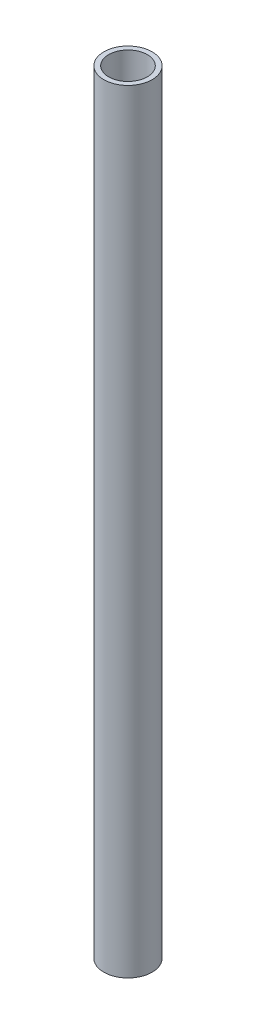
ISO-10303-21;
HEADER;
FILE_DESCRIPTION(('STEP AP214'),'2;1');
FILE_NAME('part.step','',(''),(''),'','','');
FILE_SCHEMA(('AUTOMOTIVE_DESIGN { 1 0 10303 214 1 1 1 1 }'));
ENDSEC;
DATA;
#1=APPLICATION_CONTEXT('core data for automotive mechanical design processes');
#2=APPLICATION_PROTOCOL_DEFINITION('international standard','automotive_design',2000,#1);
#3=PRODUCT_CONTEXT('',#1,'mechanical');
#4=PRODUCT('Part','Part','',(#3));
#5=PRODUCT_RELATED_PRODUCT_CATEGORY('part','',(#4));
#6=PRODUCT_DEFINITION_FORMATION('','',#4);
#7=PRODUCT_DEFINITION_CONTEXT('part definition',#1,'design');
#8=PRODUCT_DEFINITION('design','',#6,#7);
#9=PRODUCT_DEFINITION_SHAPE('','',#8);
#10=(LENGTH_UNIT() NAMED_UNIT(*) SI_UNIT(.MILLI.,.METRE.));
#11=(NAMED_UNIT(*) PLANE_ANGLE_UNIT() SI_UNIT($,.RADIAN.));
#12=(NAMED_UNIT(*) SI_UNIT($,.STERADIAN.) SOLID_ANGLE_UNIT());
#13=UNCERTAINTY_MEASURE_WITH_UNIT(LENGTH_MEASURE(1.E-05),#10,'distance_accuracy_value','');
#14=(GEOMETRIC_REPRESENTATION_CONTEXT(3) GLOBAL_UNCERTAINTY_ASSIGNED_CONTEXT((#13)) GLOBAL_UNIT_ASSIGNED_CONTEXT((#10,
#11,#12)) REPRESENTATION_CONTEXT('',''));
#15=CARTESIAN_POINT('',(0.,0.,0.));
#16=DIRECTION('',(0.,0.,1.));
#17=DIRECTION('',(1.,0.,0.));
#18=AXIS2_PLACEMENT_3D('',#15,#16,#17);
#19=CARTESIAN_POINT('',(0.,152.4,0.));
#20=DIRECTION('',(0.,1.,0.));
#21=DIRECTION('',(0.,0.,1.));
#22=AXIS2_PLACEMENT_3D('',#19,#20,#21);
#23=PLANE('',#22);
#24=CARTESIAN_POINT('',(0.,152.4,0.));
#25=DIRECTION('',(0.,1.,0.));
#26=DIRECTION('',(0.,0.,1.));
#27=AXIS2_PLACEMENT_3D('',#24,#25,#26);
#28=CIRCLE('',#27,4.7625);
#29=CARTESIAN_POINT('',(0.,152.4,4.7625));
#30=VERTEX_POINT('',#29);
#31=EDGE_CURVE('E10',#30,#30,#28,.T.);
#32=ORIENTED_EDGE('',*,*,#31,.T.);
#33=EDGE_LOOP('',(#32));
#34=FACE_BOUND('',#33,.T.);
#35=CARTESIAN_POINT('',(0.,152.4,0.));
#36=DIRECTION('',(0.,1.,0.));
#37=DIRECTION('',(0.,0.,1.));
#38=AXIS2_PLACEMENT_3D('',#35,#36,#37);
#39=CIRCLE('',#38,3.81);
#40=CARTESIAN_POINT('',(0.,152.4,3.81));
#41=VERTEX_POINT('',#40);
#42=EDGE_CURVE('E42',#41,#41,#39,.T.);
#43=ORIENTED_EDGE('',*,*,#42,.F.);
#44=EDGE_LOOP('',(#43));
#45=FACE_BOUND('',#44,.T.);
#46=ADVANCED_FACE('F31',(#34,#45),#23,.T.);
#47=CARTESIAN_POINT('',(0.,0.,0.));
#48=DIRECTION('',(0.,1.,0.));
#49=DIRECTION('',(0.,0.,1.));
#50=AXIS2_PLACEMENT_3D('',#47,#48,#49);
#51=PLANE('',#50);
#52=CARTESIAN_POINT('',(0.,0.,0.));
#53=DIRECTION('',(0.,1.,0.));
#54=DIRECTION('',(0.,0.,1.));
#55=AXIS2_PLACEMENT_3D('',#52,#53,#54);
#56=CIRCLE('',#55,4.7625);
#57=CARTESIAN_POINT('',(0.,0.,4.7625));
#58=VERTEX_POINT('',#57);
#59=EDGE_CURVE('E35',#58,#58,#56,.T.);
#60=ORIENTED_EDGE('',*,*,#59,.F.);
#61=EDGE_LOOP('',(#60));
#62=FACE_BOUND('',#61,.T.);
#63=CARTESIAN_POINT('',(0.,0.,0.));
#64=DIRECTION('',(0.,1.,0.));
#65=DIRECTION('',(0.,0.,1.));
#66=AXIS2_PLACEMENT_3D('',#63,#64,#65);
#67=CIRCLE('',#66,3.81);
#68=CARTESIAN_POINT('',(0.,0.,3.81));
#69=VERTEX_POINT('',#68);
#70=EDGE_CURVE('E44',#69,#69,#67,.T.);
#71=ORIENTED_EDGE('',*,*,#70,.T.);
#72=EDGE_LOOP('',(#71));
#73=FACE_BOUND('',#72,.T.);
#74=ADVANCED_FACE('F54',(#62,#73),#51,.F.);
#75=CARTESIAN_POINT('',(0.,152.4,0.));
#76=DIRECTION('',(0.,-1.,0.));
#77=DIRECTION('',(0.,0.,-1.));
#78=AXIS2_PLACEMENT_3D('',#75,#76,#77);
#79=CYLINDRICAL_SURFACE('',#78,4.7625);
#80=ORIENTED_EDGE('',*,*,#31,.F.);
#81=EDGE_LOOP('',(#80));
#82=FACE_BOUND('',#81,.T.);
#83=ORIENTED_EDGE('',*,*,#59,.T.);
#84=EDGE_LOOP('',(#83));
#85=FACE_BOUND('',#84,.T.);
#86=ADVANCED_FACE('F33',(#82,#85),#79,.T.);
#87=CARTESIAN_POINT('',(0.,152.4,0.));
#88=DIRECTION('',(0.,-1.,0.));
#89=DIRECTION('',(0.,0.,-1.));
#90=AXIS2_PLACEMENT_3D('',#87,#88,#89);
#91=CYLINDRICAL_SURFACE('',#90,3.81);
#92=ORIENTED_EDGE('',*,*,#42,.T.);
#93=EDGE_LOOP('',(#92));
#94=FACE_BOUND('',#93,.T.);
#95=ORIENTED_EDGE('',*,*,#70,.F.);
#96=EDGE_LOOP('',(#95));
#97=FACE_BOUND('',#96,.T.);
#98=ADVANCED_FACE('F50',(#94,#97),#91,.F.);
#99=CLOSED_SHELL('',(#46,#74,#86,#98));
#100=MANIFOLD_SOLID_BREP('B2',#99);
#101=ADVANCED_BREP_SHAPE_REPRESENTATION('',(#18,#100),#14);
#102=SHAPE_DEFINITION_REPRESENTATION(#9,#101);
ENDSEC;
END-ISO-10303-21;
